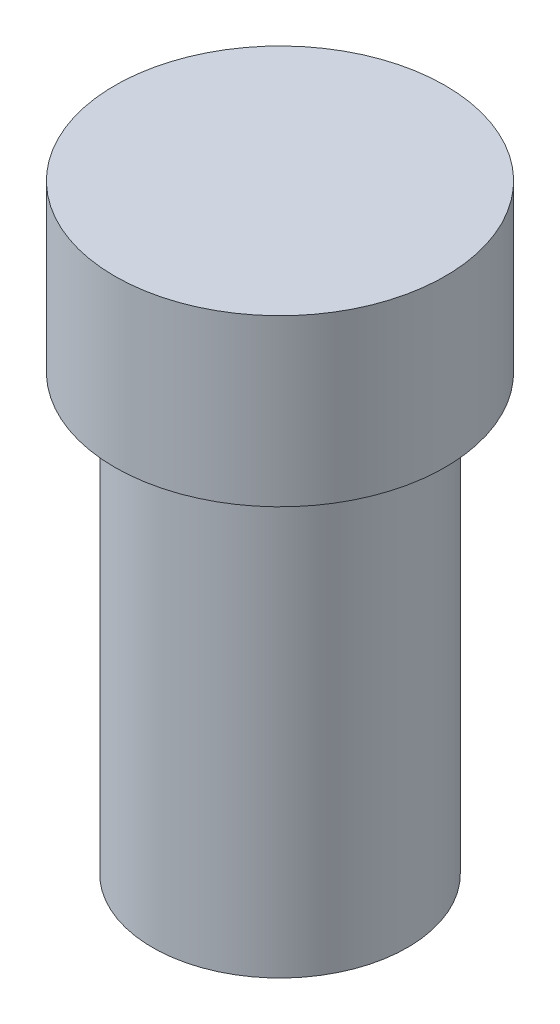
ISO-10303-21;
HEADER;
FILE_DESCRIPTION(('STEP AP214'),'2;1');
FILE_NAME('part.step','',(''),(''),'','','');
FILE_SCHEMA(('AUTOMOTIVE_DESIGN { 1 0 10303 214 1 1 1 1 }'));
ENDSEC;
DATA;
#1=APPLICATION_CONTEXT('core data for automotive mechanical design processes');
#2=APPLICATION_PROTOCOL_DEFINITION('international standard','automotive_design',2000,#1);
#3=PRODUCT_CONTEXT('',#1,'mechanical');
#4=PRODUCT('Part','Part','',(#3));
#5=PRODUCT_RELATED_PRODUCT_CATEGORY('part','',(#4));
#6=PRODUCT_DEFINITION_FORMATION('','',#4);
#7=PRODUCT_DEFINITION_CONTEXT('part definition',#1,'design');
#8=PRODUCT_DEFINITION('design','',#6,#7);
#9=PRODUCT_DEFINITION_SHAPE('','',#8);
#10=(LENGTH_UNIT() NAMED_UNIT(*) SI_UNIT(.MILLI.,.METRE.));
#11=(NAMED_UNIT(*) PLANE_ANGLE_UNIT() SI_UNIT($,.RADIAN.));
#12=(NAMED_UNIT(*) SI_UNIT($,.STERADIAN.) SOLID_ANGLE_UNIT());
#13=UNCERTAINTY_MEASURE_WITH_UNIT(LENGTH_MEASURE(1.E-05),#10,'distance_accuracy_value','');
#14=(GEOMETRIC_REPRESENTATION_CONTEXT(3) GLOBAL_UNCERTAINTY_ASSIGNED_CONTEXT((#13)) GLOBAL_UNIT_ASSIGNED_CONTEXT((#10,
#11,#12)) REPRESENTATION_CONTEXT('',''));
#15=CARTESIAN_POINT('',(0.,0.,0.));
#16=DIRECTION('',(0.,0.,1.));
#17=DIRECTION('',(1.,0.,0.));
#18=AXIS2_PLACEMENT_3D('',#15,#16,#17);
#19=CARTESIAN_POINT('',(0.,-75.,0.));
#20=DIRECTION('',(0.,1.,0.));
#21=DIRECTION('',(0.,0.,1.));
#22=AXIS2_PLACEMENT_3D('',#19,#20,#21);
#23=PLANE('',#22);
#24=CARTESIAN_POINT('',(0.,-75.,0.));
#25=DIRECTION('',(0.,-1.,0.));
#26=DIRECTION('',(0.,0.,-1.));
#27=AXIS2_PLACEMENT_3D('',#24,#25,#26);
#28=CIRCLE('',#27,22.);
#29=CARTESIAN_POINT('',(0.,-75.,-22.));
#30=VERTEX_POINT('',#29);
#31=EDGE_CURVE('E45',#30,#30,#28,.T.);
#32=ORIENTED_EDGE('',*,*,#31,.T.);
#33=EDGE_LOOP('',(#32));
#34=FACE_BOUND('',#33,.T.);
#35=ADVANCED_FACE('F31',(#34),#23,.F.);
#36=CARTESIAN_POINT('',(0.,28.5508593700083,0.));
#37=DIRECTION('',(0.,-1.,0.));
#38=DIRECTION('',(0.,0.,-1.));
#39=AXIS2_PLACEMENT_3D('',#36,#37,#38);
#40=PLANE('',#39);
#41=CARTESIAN_POINT('',(0.,28.5508593700083,0.));
#42=DIRECTION('',(0.,-1.,0.));
#43=DIRECTION('',(0.,0.,-1.));
#44=AXIS2_PLACEMENT_3D('',#41,#42,#43);
#45=CIRCLE('',#44,28.5);
#46=CARTESIAN_POINT('',(0.,28.5508593700083,-28.5));
#47=VERTEX_POINT('',#46);
#48=EDGE_CURVE('E10',#47,#47,#45,.T.);
#49=ORIENTED_EDGE('',*,*,#48,.F.);
#50=EDGE_LOOP('',(#49));
#51=FACE_BOUND('',#50,.T.);
#52=ADVANCED_FACE('F65',(#51),#40,.F.);
#53=CARTESIAN_POINT('',(0.,0.,0.));
#54=DIRECTION('',(0.,-1.,0.));
#55=DIRECTION('',(0.,0.,-1.));
#56=AXIS2_PLACEMENT_3D('',#53,#54,#55);
#57=CYLINDRICAL_SURFACE('',#56,28.5);
#58=CARTESIAN_POINT('',(0.,0.,0.));
#59=DIRECTION('',(0.,-1.,0.));
#60=DIRECTION('',(0.,0.,-1.));
#61=AXIS2_PLACEMENT_3D('',#58,#59,#60);
#62=CIRCLE('',#61,28.5);
#63=CARTESIAN_POINT('',(0.,0.,-28.5));
#64=VERTEX_POINT('',#63);
#65=EDGE_CURVE('E37',#64,#64,#62,.T.);
#66=ORIENTED_EDGE('',*,*,#65,.F.);
#67=EDGE_LOOP('',(#66));
#68=FACE_BOUND('',#67,.T.);
#69=ORIENTED_EDGE('',*,*,#48,.T.);
#70=EDGE_LOOP('',(#69));
#71=FACE_BOUND('',#70,.T.);
#72=ADVANCED_FACE('F60',(#68,#71),#57,.T.);
#73=CARTESIAN_POINT('',(-22.,0.,0.));
#74=DIRECTION('',(0.,1.,0.));
#75=DIRECTION('',(0.,0.,1.));
#76=AXIS2_PLACEMENT_3D('',#73,#74,#75);
#77=PLANE('',#76);
#78=CARTESIAN_POINT('',(0.,0.,0.));
#79=DIRECTION('',(0.,-1.,0.));
#80=DIRECTION('',(0.,0.,-1.));
#81=AXIS2_PLACEMENT_3D('',#78,#79,#80);
#82=CIRCLE('',#81,22.);
#83=CARTESIAN_POINT('',(0.,0.,-22.));
#84=VERTEX_POINT('',#83);
#85=EDGE_CURVE('E41',#84,#84,#82,.T.);
#86=ORIENTED_EDGE('',*,*,#85,.F.);
#87=EDGE_LOOP('',(#86));
#88=FACE_BOUND('',#87,.T.);
#89=ORIENTED_EDGE('',*,*,#65,.T.);
#90=EDGE_LOOP('',(#89));
#91=FACE_BOUND('',#90,.T.);
#92=ADVANCED_FACE('F55',(#88,#91),#77,.F.);
#93=CARTESIAN_POINT('',(0.,0.,0.));
#94=DIRECTION('',(0.,-1.,0.));
#95=DIRECTION('',(0.,0.,-1.));
#96=AXIS2_PLACEMENT_3D('',#93,#94,#95);
#97=CYLINDRICAL_SURFACE('',#96,22.);
#98=ORIENTED_EDGE('',*,*,#31,.F.);
#99=EDGE_LOOP('',(#98));
#100=FACE_BOUND('',#99,.T.);
#101=ORIENTED_EDGE('',*,*,#85,.T.);
#102=EDGE_LOOP('',(#101));
#103=FACE_BOUND('',#102,.T.);
#104=ADVANCED_FACE('F52',(#100,#103),#97,.T.);
#105=CLOSED_SHELL('',(#35,#52,#72,#92,#104));
#106=MANIFOLD_SOLID_BREP('B2',#105);
#107=ADVANCED_BREP_SHAPE_REPRESENTATION('',(#18,#106),#14);
#108=SHAPE_DEFINITION_REPRESENTATION(#9,#107);
ENDSEC;
END-ISO-10303-21;
